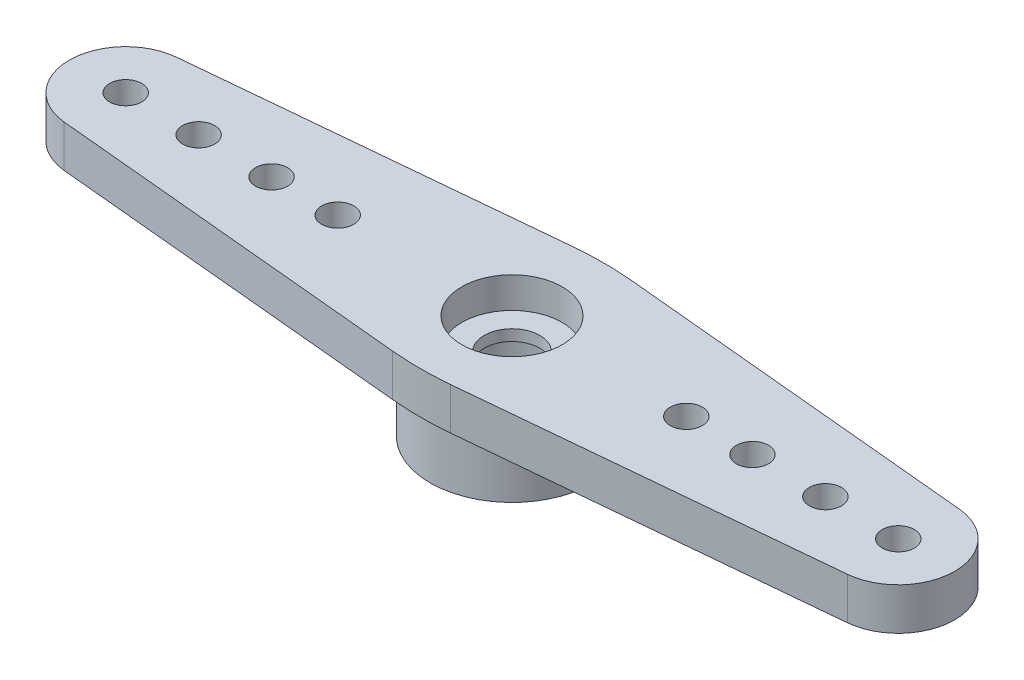
ISO-10303-21;
HEADER;
FILE_DESCRIPTION(('STEP AP214'),'2;1');
FILE_NAME('part.step','',(''),(''),'','','');
FILE_SCHEMA(('AUTOMOTIVE_DESIGN { 1 0 10303 214 1 1 1 1 }'));
ENDSEC;
DATA;
#1=APPLICATION_CONTEXT('core data for automotive mechanical design processes');
#2=APPLICATION_PROTOCOL_DEFINITION('international standard','automotive_design',2000,#1);
#3=PRODUCT_CONTEXT('',#1,'mechanical');
#4=PRODUCT('Part','Part','',(#3));
#5=PRODUCT_RELATED_PRODUCT_CATEGORY('part','',(#4));
#6=PRODUCT_DEFINITION_FORMATION('','',#4);
#7=PRODUCT_DEFINITION_CONTEXT('part definition',#1,'design');
#8=PRODUCT_DEFINITION('design','',#6,#7);
#9=PRODUCT_DEFINITION_SHAPE('','',#8);
#10=(LENGTH_UNIT() NAMED_UNIT(*) SI_UNIT(.MILLI.,.METRE.));
#11=(NAMED_UNIT(*) PLANE_ANGLE_UNIT() SI_UNIT($,.RADIAN.));
#12=(NAMED_UNIT(*) SI_UNIT($,.STERADIAN.) SOLID_ANGLE_UNIT());
#13=UNCERTAINTY_MEASURE_WITH_UNIT(LENGTH_MEASURE(1.E-05),#10,'distance_accuracy_value','');
#14=(GEOMETRIC_REPRESENTATION_CONTEXT(3) GLOBAL_UNCERTAINTY_ASSIGNED_CONTEXT((#13)) GLOBAL_UNIT_ASSIGNED_CONTEXT((#10,
#11,#12)) REPRESENTATION_CONTEXT('',''));
#15=CARTESIAN_POINT('',(0.,0.,0.));
#16=DIRECTION('',(0.,0.,1.));
#17=DIRECTION('',(1.,0.,0.));
#18=AXIS2_PLACEMENT_3D('',#15,#16,#17);
#19=CARTESIAN_POINT('',(0.,4.2672,0.));
#20=DIRECTION('',(0.,-1.,0.));
#21=DIRECTION('',(0.,0.,-1.));
#22=AXIS2_PLACEMENT_3D('',#19,#20,#21);
#23=CYLINDRICAL_SURFACE('',#22,1.143);
#24=CARTESIAN_POINT('',(0.,2.54,0.));
#25=DIRECTION('',(0.,1.,0.));
#26=DIRECTION('',(0.,0.,1.));
#27=AXIS2_PLACEMENT_3D('',#24,#25,#26);
#28=CIRCLE('',#27,1.143);
#29=CARTESIAN_POINT('',(0.,2.54,1.143));
#30=VERTEX_POINT('',#29);
#31=EDGE_CURVE('E196',#30,#30,#28,.T.);
#32=ORIENTED_EDGE('',*,*,#31,.F.);
#33=EDGE_LOOP('',(#32));
#34=FACE_BOUND('',#33,.T.);
#35=CARTESIAN_POINT('',(0.,2.9972,0.));
#36=DIRECTION('',(0.,1.,0.));
#37=DIRECTION('',(0.,0.,1.));
#38=AXIS2_PLACEMENT_3D('',#35,#36,#37);
#39=CIRCLE('',#38,1.143);
#40=CARTESIAN_POINT('',(0.,2.9972,1.143));
#41=VERTEX_POINT('',#40);
#42=EDGE_CURVE('E356',#41,#41,#39,.F.);
#43=ORIENTED_EDGE('',*,*,#42,.F.);
#44=EDGE_LOOP('',(#43));
#45=FACE_BOUND('',#44,.T.);
#46=ADVANCED_FACE('F34',(#34,#45),#23,.F.);
#47=CARTESIAN_POINT('',(0.,0.,0.));
#48=DIRECTION('',(0.,1.,0.));
#49=DIRECTION('',(0.,0.,1.));
#50=AXIS2_PLACEMENT_3D('',#47,#48,#49);
#51=PLANE('',#50);
#52=CARTESIAN_POINT('',(0.,0.,0.));
#53=DIRECTION('',(0.,1.,0.));
#54=DIRECTION('',(0.,0.,1.));
#55=AXIS2_PLACEMENT_3D('',#52,#53,#54);
#56=CIRCLE('',#55,3.3655);
#57=CARTESIAN_POINT('',(0.,0.,3.3655));
#58=VERTEX_POINT('',#57);
#59=EDGE_CURVE('E210',#58,#58,#56,.T.);
#60=ORIENTED_EDGE('',*,*,#59,.F.);
#61=EDGE_LOOP('',(#60));
#62=FACE_BOUND('',#61,.T.);
#63=CARTESIAN_POINT('',(0.,0.,0.));
#64=DIRECTION('',(0.,1.,0.));
#65=DIRECTION('',(0.,0.,1.));
#66=AXIS2_PLACEMENT_3D('',#63,#64,#65);
#67=CIRCLE('',#66,2.2352);
#68=CARTESIAN_POINT('',(0.,0.,2.2352));
#69=VERTEX_POINT('',#68);
#70=EDGE_CURVE('E207',#69,#69,#67,.T.);
#71=ORIENTED_EDGE('',*,*,#70,.T.);
#72=EDGE_LOOP('',(#71));
#73=FACE_BOUND('',#72,.T.);
#74=ADVANCED_FACE('F257',(#62,#73),#51,.F.);
#75=CARTESIAN_POINT('',(0.,2.54,0.));
#76=DIRECTION('',(0.,-1.,0.));
#77=DIRECTION('',(0.,0.,-1.));
#78=AXIS2_PLACEMENT_3D('',#75,#76,#77);
#79=CYLINDRICAL_SURFACE('',#78,3.3655);
#80=CARTESIAN_POINT('',(0.,2.54,0.));
#81=DIRECTION('',(0.,1.,0.));
#82=DIRECTION('',(0.,0.,1.));
#83=AXIS2_PLACEMENT_3D('',#80,#81,#82);
#84=CIRCLE('',#83,3.3655);
#85=CARTESIAN_POINT('',(0.,2.54,3.3655));
#86=VERTEX_POINT('',#85);
#87=EDGE_CURVE('E211',#86,#86,#84,.T.);
#88=ORIENTED_EDGE('',*,*,#87,.F.);
#89=EDGE_LOOP('',(#88));
#90=FACE_BOUND('',#89,.T.);
#91=ORIENTED_EDGE('',*,*,#59,.T.);
#92=EDGE_LOOP('',(#91));
#93=FACE_BOUND('',#92,.T.);
#94=ADVANCED_FACE('F263',(#90,#93),#79,.T.);
#95=CARTESIAN_POINT('',(0.,2.54,0.));
#96=DIRECTION('',(0.,-1.,0.));
#97=DIRECTION('',(0.,0.,-1.));
#98=AXIS2_PLACEMENT_3D('',#95,#96,#97);
#99=CYLINDRICAL_SURFACE('',#98,2.2352);
#100=CARTESIAN_POINT('',(0.,2.54,0.));
#101=DIRECTION('',(0.,1.,0.));
#102=DIRECTION('',(0.,0.,1.));
#103=AXIS2_PLACEMENT_3D('',#100,#101,#102);
#104=CIRCLE('',#103,2.2352);
#105=CARTESIAN_POINT('',(0.,2.54,2.2352));
#106=VERTEX_POINT('',#105);
#107=EDGE_CURVE('E119',#106,#106,#104,.T.);
#108=ORIENTED_EDGE('',*,*,#107,.T.);
#109=EDGE_LOOP('',(#108));
#110=FACE_BOUND('',#109,.T.);
#111=ORIENTED_EDGE('',*,*,#70,.F.);
#112=EDGE_LOOP('',(#111));
#113=FACE_BOUND('',#112,.T.);
#114=ADVANCED_FACE('F316',(#110,#113),#99,.F.);
#115=CARTESIAN_POINT('',(0.,2.54,0.));
#116=DIRECTION('',(0.,1.,0.));
#117=DIRECTION('',(0.,0.,1.));
#118=AXIS2_PLACEMENT_3D('',#115,#116,#117);
#119=PLANE('',#118);
#120=CARTESIAN_POINT('',(-9.8806,2.54,0.));
#121=DIRECTION('',(0.,1.,0.));
#122=DIRECTION('',(0.,0.,1.));
#123=AXIS2_PLACEMENT_3D('',#120,#121,#122);
#124=CIRCLE('',#123,0.6604);
#125=CARTESIAN_POINT('',(-9.8806,2.54,0.6604));
#126=VERTEX_POINT('',#125);
#127=EDGE_CURVE('E159',#126,#126,#124,.F.);
#128=ORIENTED_EDGE('',*,*,#127,.F.);
#129=EDGE_LOOP('',(#128));
#130=FACE_BOUND('',#129,.T.);
#131=DIRECTION('',(-0.995596740434201,0.,0.0937396950965555));
#132=VECTOR('',#131,1.);
#133=CARTESIAN_POINT('',(-0.356760873994165,2.54,-3.78910943647926));
#134=LINE('',#133,#132);
#135=CARTESIAN_POINT('',(-1.19049412772625,2.54,-3.71060988156648));
#136=VERTEX_POINT('',#135);
#137=CARTESIAN_POINT('',(-16.09226517831,2.54,-2.30754434514137));
#138=VERTEX_POINT('',#137);
#139=EDGE_CURVE('E115',#136,#138,#134,.T.);
#140=ORIENTED_EDGE('',*,*,#139,.F.);
#141=CARTESIAN_POINT('',(0.,2.54,8.93346872194787));
#142=DIRECTION('',(0.,1.,0.));
#143=DIRECTION('',(0.,0.,1.));
#144=AXIS2_PLACEMENT_3D('',#141,#142,#143);
#145=CIRCLE('',#144,12.7);
#146=CARTESIAN_POINT('',(1.19049412772625,2.54,-3.71060988156648));
#147=VERTEX_POINT('',#146);
#148=EDGE_CURVE('E220',#136,#147,#145,.F.);
#149=ORIENTED_EDGE('',*,*,#148,.T.);
#150=DIRECTION('',(0.995596740434201,0.,0.0937396950965555));
#151=VECTOR('',#150,1.);
#152=CARTESIAN_POINT('',(0.356760873994165,2.54,-3.78910943647926));
#153=LINE('',#152,#151);
#154=CARTESIAN_POINT('',(16.09226517831,2.54,-2.30754434514137));
#155=VERTEX_POINT('',#154);
#156=EDGE_CURVE('E173',#147,#155,#153,.T.);
#157=ORIENTED_EDGE('',*,*,#156,.T.);
#158=CARTESIAN_POINT('',(15.875,2.54,0.));
#159=DIRECTION('',(0.,1.,0.));
#160=DIRECTION('',(0.,0.,1.));
#161=AXIS2_PLACEMENT_3D('',#158,#159,#160);
#162=CIRCLE('',#161,2.31775);
#163=CARTESIAN_POINT('',(16.09226517831,2.54,2.30754434514137));
#164=VERTEX_POINT('',#163);
#165=EDGE_CURVE('E170',#164,#155,#162,.T.);
#166=ORIENTED_EDGE('',*,*,#165,.F.);
#167=DIRECTION('',(0.995596740434201,0.,-0.0937396950965555));
#168=VECTOR('',#167,1.);
#169=CARTESIAN_POINT('',(0.356760873994165,2.54,3.78910943647926));
#170=LINE('',#169,#168);
#171=CARTESIAN_POINT('',(1.19049412772625,2.54,3.71060988156648));
#172=VERTEX_POINT('',#171);
#173=EDGE_CURVE('E168',#172,#164,#170,.T.);
#174=ORIENTED_EDGE('',*,*,#173,.F.);
#175=CARTESIAN_POINT('',(0.,2.54,-8.93346872194787));
#176=DIRECTION('',(0.,1.,0.));
#177=DIRECTION('',(0.,0.,1.));
#178=AXIS2_PLACEMENT_3D('',#175,#176,#177);
#179=CIRCLE('',#178,12.7);
#180=CARTESIAN_POINT('',(-1.19049412772625,2.54,3.71060988156648));
#181=VERTEX_POINT('',#180);
#182=EDGE_CURVE('E218',#172,#181,#179,.F.);
#183=ORIENTED_EDGE('',*,*,#182,.T.);
#184=DIRECTION('',(-0.995596740434201,0.,-0.0937396950965555));
#185=VECTOR('',#184,1.);
#186=CARTESIAN_POINT('',(-0.356760873994165,2.54,3.78910943647926));
#187=LINE('',#186,#185);
#188=CARTESIAN_POINT('',(-16.09226517831,2.54,2.30754434514137));
#189=VERTEX_POINT('',#188);
#190=EDGE_CURVE('E166',#181,#189,#187,.T.);
#191=ORIENTED_EDGE('',*,*,#190,.T.);
#192=CARTESIAN_POINT('',(-15.875,2.54,0.));
#193=DIRECTION('',(0.,1.,0.));
#194=DIRECTION('',(0.,0.,1.));
#195=AXIS2_PLACEMENT_3D('',#192,#193,#194);
#196=CIRCLE('',#195,2.31775);
#197=EDGE_CURVE('E164',#189,#138,#196,.F.);
#198=ORIENTED_EDGE('',*,*,#197,.T.);
#199=EDGE_LOOP('',(#140,#149,#157,#166,#174,#183,#191,#198));
#200=FACE_BOUND('',#199,.T.);
#201=CARTESIAN_POINT('',(-7.1628,2.54,0.));
#202=DIRECTION('',(0.,1.,0.));
#203=DIRECTION('',(0.,0.,1.));
#204=AXIS2_PLACEMENT_3D('',#201,#202,#203);
#205=CIRCLE('',#204,0.6604);
#206=CARTESIAN_POINT('',(-7.1628,2.54,0.6604));
#207=VERTEX_POINT('',#206);
#208=EDGE_CURVE('E175',#207,#207,#205,.F.);
#209=ORIENTED_EDGE('',*,*,#208,.F.);
#210=EDGE_LOOP('',(#209));
#211=FACE_BOUND('',#210,.T.);
#212=CARTESIAN_POINT('',(-12.8778,2.54,0.));
#213=DIRECTION('',(0.,1.,0.));
#214=DIRECTION('',(0.,0.,1.));
#215=AXIS2_PLACEMENT_3D('',#212,#213,#214);
#216=CIRCLE('',#215,0.660399999999998);
#217=CARTESIAN_POINT('',(-12.8778,2.54,0.660399999999998));
#218=VERTEX_POINT('',#217);
#219=EDGE_CURVE('E178',#218,#218,#216,.F.);
#220=ORIENTED_EDGE('',*,*,#219,.F.);
#221=EDGE_LOOP('',(#220));
#222=FACE_BOUND('',#221,.T.);
#223=CARTESIAN_POINT('',(-15.875,2.54,0.));
#224=DIRECTION('',(0.,1.,0.));
#225=DIRECTION('',(0.,0.,1.));
#226=AXIS2_PLACEMENT_3D('',#223,#224,#225);
#227=CIRCLE('',#226,0.660399999999998);
#228=CARTESIAN_POINT('',(-15.875,2.54,0.660399999999998));
#229=VERTEX_POINT('',#228);
#230=EDGE_CURVE('E181',#229,#229,#227,.F.);
#231=ORIENTED_EDGE('',*,*,#230,.F.);
#232=EDGE_LOOP('',(#231));
#233=FACE_BOUND('',#232,.T.);
#234=CARTESIAN_POINT('',(12.8778,2.54,0.));
#235=DIRECTION('',(0.,1.,0.));
#236=DIRECTION('',(0.,0.,1.));
#237=AXIS2_PLACEMENT_3D('',#234,#235,#236);
#238=CIRCLE('',#237,0.660399999999998);
#239=CARTESIAN_POINT('',(12.8778,2.54,0.660399999999998));
#240=VERTEX_POINT('',#239);
#241=EDGE_CURVE('E184',#240,#240,#238,.T.);
#242=ORIENTED_EDGE('',*,*,#241,.T.);
#243=EDGE_LOOP('',(#242));
#244=FACE_BOUND('',#243,.T.);
#245=CARTESIAN_POINT('',(9.8806,2.54,0.));
#246=DIRECTION('',(0.,1.,0.));
#247=DIRECTION('',(0.,0.,1.));
#248=AXIS2_PLACEMENT_3D('',#245,#246,#247);
#249=CIRCLE('',#248,0.6604);
#250=CARTESIAN_POINT('',(9.8806,2.54,0.6604));
#251=VERTEX_POINT('',#250);
#252=EDGE_CURVE('E187',#251,#251,#249,.T.);
#253=ORIENTED_EDGE('',*,*,#252,.T.);
#254=EDGE_LOOP('',(#253));
#255=FACE_BOUND('',#254,.T.);
#256=CARTESIAN_POINT('',(7.1628,2.54,0.));
#257=DIRECTION('',(0.,1.,0.));
#258=DIRECTION('',(0.,0.,1.));
#259=AXIS2_PLACEMENT_3D('',#256,#257,#258);
#260=CIRCLE('',#259,0.6604);
#261=CARTESIAN_POINT('',(7.1628,2.54,0.6604));
#262=VERTEX_POINT('',#261);
#263=EDGE_CURVE('E190',#262,#262,#260,.T.);
#264=ORIENTED_EDGE('',*,*,#263,.T.);
#265=EDGE_LOOP('',(#264));
#266=FACE_BOUND('',#265,.T.);
#267=CARTESIAN_POINT('',(15.875,2.54,0.));
#268=DIRECTION('',(0.,1.,0.));
#269=DIRECTION('',(0.,0.,1.));
#270=AXIS2_PLACEMENT_3D('',#267,#268,#269);
#271=CIRCLE('',#270,0.660399999999998);
#272=CARTESIAN_POINT('',(15.875,2.54,0.660399999999998));
#273=VERTEX_POINT('',#272);
#274=EDGE_CURVE('E193',#273,#273,#271,.T.);
#275=ORIENTED_EDGE('',*,*,#274,.T.);
#276=EDGE_LOOP('',(#275));
#277=FACE_BOUND('',#276,.T.);
#278=ORIENTED_EDGE('',*,*,#87,.T.);
#279=EDGE_LOOP('',(#278));
#280=FACE_BOUND('',#279,.T.);
#281=ADVANCED_FACE('F234',(#130,#200,#211,#222,#233,#244,#255,#266,#277,#280),#119,.F.);
#282=CARTESIAN_POINT('',(-0.356760873994165,4.2672,-3.78910943647926));
#283=DIRECTION('',(0.0937396950965555,0.,0.995596740434201));
#284=DIRECTION('',(0.995596740434201,0.,-0.0937396950965555));
#285=AXIS2_PLACEMENT_3D('',#282,#283,#284);
#286=PLANE('',#285);
#287=DIRECTION('',(-0.995596740434201,0.,0.0937396950965555));
#288=VECTOR('',#287,1.);
#289=CARTESIAN_POINT('',(-0.356760873994165,4.2672,-3.78910943647926));
#290=LINE('',#289,#288);
#291=CARTESIAN_POINT('',(-1.19049412772625,4.2672,-3.71060988156648));
#292=VERTEX_POINT('',#291);
#293=CARTESIAN_POINT('',(-16.09226517831,4.2672,-2.30754434514137));
#294=VERTEX_POINT('',#293);
#295=EDGE_CURVE('E97',#292,#294,#290,.T.);
#296=ORIENTED_EDGE('',*,*,#295,.F.);
#297=DIRECTION('',(0.,-1.,0.));
#298=VECTOR('',#297,1.);
#299=CARTESIAN_POINT('',(-1.19049412772625,2.54,-3.71060988156648));
#300=LINE('',#299,#298);
#301=EDGE_CURVE('E214',#292,#136,#300,.T.);
#302=ORIENTED_EDGE('',*,*,#301,.T.);
#303=ORIENTED_EDGE('',*,*,#139,.T.);
#304=DIRECTION('',(0.,-1.,0.));
#305=VECTOR('',#304,1.);
#306=CARTESIAN_POINT('',(-16.09226517831,4.2672,-2.30754434514137));
#307=LINE('',#306,#305);
#308=EDGE_CURVE('E112',#294,#138,#307,.T.);
#309=ORIENTED_EDGE('',*,*,#308,.F.);
#310=EDGE_LOOP('',(#296,#302,#303,#309));
#311=FACE_BOUND('',#310,.T.);
#312=ADVANCED_FACE('F113',(#311),#286,.F.);
#313=CARTESIAN_POINT('',(-15.875,4.2672,0.));
#314=DIRECTION('',(0.,-1.,0.));
#315=DIRECTION('',(0.,0.,-1.));
#316=AXIS2_PLACEMENT_3D('',#313,#314,#315);
#317=CYLINDRICAL_SURFACE('',#316,2.31775);
#318=ORIENTED_EDGE('',*,*,#197,.F.);
#319=DIRECTION('',(0.,-1.,0.));
#320=VECTOR('',#319,1.);
#321=CARTESIAN_POINT('',(-16.09226517831,4.2672,2.30754434514137));
#322=LINE('',#321,#320);
#323=CARTESIAN_POINT('',(-16.09226517831,4.2672,2.30754434514137));
#324=VERTEX_POINT('',#323);
#325=EDGE_CURVE('E120',#324,#189,#322,.T.);
#326=ORIENTED_EDGE('',*,*,#325,.F.);
#327=CARTESIAN_POINT('',(-15.875,4.2672,0.));
#328=DIRECTION('',(0.,1.,0.));
#329=DIRECTION('',(0.,0.,1.));
#330=AXIS2_PLACEMENT_3D('',#327,#328,#329);
#331=CIRCLE('',#330,2.31775);
#332=EDGE_CURVE('E103',#324,#294,#331,.F.);
#333=ORIENTED_EDGE('',*,*,#332,.T.);
#334=ORIENTED_EDGE('',*,*,#308,.T.);
#335=EDGE_LOOP('',(#318,#326,#333,#334));
#336=FACE_BOUND('',#335,.T.);
#337=ADVANCED_FACE('F123',(#336),#317,.T.);
#338=CARTESIAN_POINT('',(-0.356760873994165,4.2672,3.78910943647926));
#339=DIRECTION('',(-0.0937396950965555,0.,0.995596740434201));
#340=DIRECTION('',(0.995596740434201,0.,0.0937396950965555));
#341=AXIS2_PLACEMENT_3D('',#338,#339,#340);
#342=PLANE('',#341);
#343=ORIENTED_EDGE('',*,*,#190,.F.);
#344=DIRECTION('',(0.,-1.,0.));
#345=VECTOR('',#344,1.);
#346=CARTESIAN_POINT('',(-1.19049412772625,4.2672,3.71060988156648));
#347=LINE('',#346,#345);
#348=CARTESIAN_POINT('',(-1.19049412772625,4.2672,3.71060988156648));
#349=VERTEX_POINT('',#348);
#350=EDGE_CURVE('E11',#181,#349,#347,.F.);
#351=ORIENTED_EDGE('',*,*,#350,.T.);
#352=DIRECTION('',(-0.995596740434201,0.,-0.0937396950965555));
#353=VECTOR('',#352,1.);
#354=CARTESIAN_POINT('',(-0.356760873994165,4.2672,3.78910943647926));
#355=LINE('',#354,#353);
#356=EDGE_CURVE('E125',#349,#324,#355,.T.);
#357=ORIENTED_EDGE('',*,*,#356,.T.);
#358=ORIENTED_EDGE('',*,*,#325,.T.);
#359=EDGE_LOOP('',(#343,#351,#357,#358));
#360=FACE_BOUND('',#359,.T.);
#361=ADVANCED_FACE('F245',(#360),#342,.T.);
#362=CARTESIAN_POINT('',(0.356760873994165,4.2672,3.78910943647926));
#363=DIRECTION('',(-0.0937396950965555,0.,-0.995596740434201));
#364=DIRECTION('',(-0.995596740434201,0.,0.0937396950965555));
#365=AXIS2_PLACEMENT_3D('',#362,#363,#364);
#366=PLANE('',#365);
#367=DIRECTION('',(0.995596740434201,0.,-0.0937396950965555));
#368=VECTOR('',#367,1.);
#369=CARTESIAN_POINT('',(0.356760873994165,4.2672,3.78910943647926));
#370=LINE('',#369,#368);
#371=CARTESIAN_POINT('',(1.19049412772625,4.2672,3.71060988156648));
#372=VERTEX_POINT('',#371);
#373=CARTESIAN_POINT('',(16.09226517831,4.2672,2.30754434514137));
#374=VERTEX_POINT('',#373);
#375=EDGE_CURVE('E127',#372,#374,#370,.T.);
#376=ORIENTED_EDGE('',*,*,#375,.F.);
#377=DIRECTION('',(0.,-1.,0.));
#378=VECTOR('',#377,1.);
#379=CARTESIAN_POINT('',(1.19049412772625,2.54,3.71060988156648));
#380=LINE('',#379,#378);
#381=EDGE_CURVE('E42',#372,#172,#380,.T.);
#382=ORIENTED_EDGE('',*,*,#381,.T.);
#383=ORIENTED_EDGE('',*,*,#173,.T.);
#384=DIRECTION('',(0.,-1.,0.));
#385=VECTOR('',#384,1.);
#386=CARTESIAN_POINT('',(16.09226517831,4.2672,2.30754434514137));
#387=LINE('',#386,#385);
#388=EDGE_CURVE('E201',#374,#164,#387,.T.);
#389=ORIENTED_EDGE('',*,*,#388,.F.);
#390=EDGE_LOOP('',(#376,#382,#383,#389));
#391=FACE_BOUND('',#390,.T.);
#392=ADVANCED_FACE('F229',(#391),#366,.F.);
#393=CARTESIAN_POINT('',(15.875,4.2672,0.));
#394=DIRECTION('',(0.,-1.,0.));
#395=DIRECTION('',(0.,0.,-1.));
#396=AXIS2_PLACEMENT_3D('',#393,#394,#395);
#397=CYLINDRICAL_SURFACE('',#396,2.31775);
#398=ORIENTED_EDGE('',*,*,#165,.T.);
#399=DIRECTION('',(0.,-1.,0.));
#400=VECTOR('',#399,1.);
#401=CARTESIAN_POINT('',(16.09226517831,4.2672,-2.30754434514137));
#402=LINE('',#401,#400);
#403=CARTESIAN_POINT('',(16.09226517831,4.2672,-2.30754434514137));
#404=VERTEX_POINT('',#403);
#405=EDGE_CURVE('E158',#404,#155,#402,.T.);
#406=ORIENTED_EDGE('',*,*,#405,.F.);
#407=CARTESIAN_POINT('',(15.875,4.2672,0.));
#408=DIRECTION('',(0.,1.,0.));
#409=DIRECTION('',(0.,0.,1.));
#410=AXIS2_PLACEMENT_3D('',#407,#408,#409);
#411=CIRCLE('',#410,2.31775);
#412=EDGE_CURVE('E132',#374,#404,#411,.T.);
#413=ORIENTED_EDGE('',*,*,#412,.F.);
#414=ORIENTED_EDGE('',*,*,#388,.T.);
#415=EDGE_LOOP('',(#398,#406,#413,#414));
#416=FACE_BOUND('',#415,.T.);
#417=ADVANCED_FACE('F239',(#416),#397,.T.);
#418=CARTESIAN_POINT('',(15.875,4.2672,0.));
#419=DIRECTION('',(0.,-1.,0.));
#420=DIRECTION('',(0.,0.,-1.));
#421=AXIS2_PLACEMENT_3D('',#418,#419,#420);
#422=CYLINDRICAL_SURFACE('',#421,0.660399999999998);
#423=CARTESIAN_POINT('',(15.875,4.2672,0.));
#424=DIRECTION('',(0.,1.,0.));
#425=DIRECTION('',(0.,0.,1.));
#426=AXIS2_PLACEMENT_3D('',#423,#424,#425);
#427=CIRCLE('',#426,0.660399999999998);
#428=CARTESIAN_POINT('',(15.875,4.2672,0.660399999999998));
#429=VERTEX_POINT('',#428);
#430=EDGE_CURVE('E155',#429,#429,#427,.T.);
#431=ORIENTED_EDGE('',*,*,#430,.T.);
#432=EDGE_LOOP('',(#431));
#433=FACE_BOUND('',#432,.T.);
#434=ORIENTED_EDGE('',*,*,#274,.F.);
#435=EDGE_LOOP('',(#434));
#436=FACE_BOUND('',#435,.T.);
#437=ADVANCED_FACE('F271',(#433,#436),#422,.F.);
#438=CARTESIAN_POINT('',(7.1628,4.2672,0.));
#439=DIRECTION('',(0.,-1.,0.));
#440=DIRECTION('',(0.,0.,-1.));
#441=AXIS2_PLACEMENT_3D('',#438,#439,#440);
#442=CYLINDRICAL_SURFACE('',#441,0.6604);
#443=CARTESIAN_POINT('',(7.1628,4.2672,0.));
#444=DIRECTION('',(0.,1.,0.));
#445=DIRECTION('',(0.,0.,1.));
#446=AXIS2_PLACEMENT_3D('',#443,#444,#445);
#447=CIRCLE('',#446,0.6604);
#448=CARTESIAN_POINT('',(7.1628,4.2672,0.6604));
#449=VERTEX_POINT('',#448);
#450=EDGE_CURVE('E152',#449,#449,#447,.T.);
#451=ORIENTED_EDGE('',*,*,#450,.T.);
#452=EDGE_LOOP('',(#451));
#453=FACE_BOUND('',#452,.T.);
#454=ORIENTED_EDGE('',*,*,#263,.F.);
#455=EDGE_LOOP('',(#454));
#456=FACE_BOUND('',#455,.T.);
#457=ADVANCED_FACE('F274',(#453,#456),#442,.F.);
#458=CARTESIAN_POINT('',(9.8806,4.2672,0.));
#459=DIRECTION('',(0.,-1.,0.));
#460=DIRECTION('',(0.,0.,-1.));
#461=AXIS2_PLACEMENT_3D('',#458,#459,#460);
#462=CYLINDRICAL_SURFACE('',#461,0.6604);
#463=CARTESIAN_POINT('',(9.8806,4.2672,0.));
#464=DIRECTION('',(0.,1.,0.));
#465=DIRECTION('',(0.,0.,1.));
#466=AXIS2_PLACEMENT_3D('',#463,#464,#465);
#467=CIRCLE('',#466,0.6604);
#468=CARTESIAN_POINT('',(9.8806,4.2672,0.6604));
#469=VERTEX_POINT('',#468);
#470=EDGE_CURVE('E149',#469,#469,#467,.T.);
#471=ORIENTED_EDGE('',*,*,#470,.T.);
#472=EDGE_LOOP('',(#471));
#473=FACE_BOUND('',#472,.T.);
#474=ORIENTED_EDGE('',*,*,#252,.F.);
#475=EDGE_LOOP('',(#474));
#476=FACE_BOUND('',#475,.T.);
#477=ADVANCED_FACE('F278',(#473,#476),#462,.F.);
#478=CARTESIAN_POINT('',(12.8778,4.2672,0.));
#479=DIRECTION('',(0.,-1.,0.));
#480=DIRECTION('',(0.,0.,-1.));
#481=AXIS2_PLACEMENT_3D('',#478,#479,#480);
#482=CYLINDRICAL_SURFACE('',#481,0.660399999999998);
#483=CARTESIAN_POINT('',(12.8778,4.2672,0.));
#484=DIRECTION('',(0.,1.,0.));
#485=DIRECTION('',(0.,0.,1.));
#486=AXIS2_PLACEMENT_3D('',#483,#484,#485);
#487=CIRCLE('',#486,0.660399999999998);
#488=CARTESIAN_POINT('',(12.8778,4.2672,0.660399999999998));
#489=VERTEX_POINT('',#488);
#490=EDGE_CURVE('E146',#489,#489,#487,.T.);
#491=ORIENTED_EDGE('',*,*,#490,.T.);
#492=EDGE_LOOP('',(#491));
#493=FACE_BOUND('',#492,.T.);
#494=ORIENTED_EDGE('',*,*,#241,.F.);
#495=EDGE_LOOP('',(#494));
#496=FACE_BOUND('',#495,.T.);
#497=ADVANCED_FACE('F282',(#493,#496),#482,.F.);
#498=CARTESIAN_POINT('',(-15.875,4.2672,0.));
#499=DIRECTION('',(0.,-1.,0.));
#500=DIRECTION('',(0.,0.,-1.));
#501=AXIS2_PLACEMENT_3D('',#498,#499,#500);
#502=CYLINDRICAL_SURFACE('',#501,0.660399999999998);
#503=CARTESIAN_POINT('',(-15.875,4.2672,0.));
#504=DIRECTION('',(0.,1.,0.));
#505=DIRECTION('',(0.,0.,1.));
#506=AXIS2_PLACEMENT_3D('',#503,#504,#505);
#507=CIRCLE('',#506,0.660399999999998);
#508=CARTESIAN_POINT('',(-15.875,4.2672,0.660399999999998));
#509=VERTEX_POINT('',#508);
#510=EDGE_CURVE('E143',#509,#509,#507,.F.);
#511=ORIENTED_EDGE('',*,*,#510,.F.);
#512=EDGE_LOOP('',(#511));
#513=FACE_BOUND('',#512,.T.);
#514=ORIENTED_EDGE('',*,*,#230,.T.);
#515=EDGE_LOOP('',(#514));
#516=FACE_BOUND('',#515,.T.);
#517=ADVANCED_FACE('F286',(#513,#516),#502,.F.);
#518=CARTESIAN_POINT('',(-12.8778,4.2672,0.));
#519=DIRECTION('',(0.,-1.,0.));
#520=DIRECTION('',(0.,0.,-1.));
#521=AXIS2_PLACEMENT_3D('',#518,#519,#520);
#522=CYLINDRICAL_SURFACE('',#521,0.660399999999998);
#523=CARTESIAN_POINT('',(-12.8778,4.2672,0.));
#524=DIRECTION('',(0.,1.,0.));
#525=DIRECTION('',(0.,0.,1.));
#526=AXIS2_PLACEMENT_3D('',#523,#524,#525);
#527=CIRCLE('',#526,0.660399999999998);
#528=CARTESIAN_POINT('',(-12.8778,4.2672,0.660399999999998));
#529=VERTEX_POINT('',#528);
#530=EDGE_CURVE('E140',#529,#529,#527,.F.);
#531=ORIENTED_EDGE('',*,*,#530,.F.);
#532=EDGE_LOOP('',(#531));
#533=FACE_BOUND('',#532,.T.);
#534=ORIENTED_EDGE('',*,*,#219,.T.);
#535=EDGE_LOOP('',(#534));
#536=FACE_BOUND('',#535,.T.);
#537=ADVANCED_FACE('F290',(#533,#536),#522,.F.);
#538=CARTESIAN_POINT('',(-7.1628,4.2672,0.));
#539=DIRECTION('',(0.,-1.,0.));
#540=DIRECTION('',(0.,0.,-1.));
#541=AXIS2_PLACEMENT_3D('',#538,#539,#540);
#542=CYLINDRICAL_SURFACE('',#541,0.6604);
#543=CARTESIAN_POINT('',(-7.1628,4.2672,0.));
#544=DIRECTION('',(0.,1.,0.));
#545=DIRECTION('',(0.,0.,1.));
#546=AXIS2_PLACEMENT_3D('',#543,#544,#545);
#547=CIRCLE('',#546,0.6604);
#548=CARTESIAN_POINT('',(-7.1628,4.2672,0.6604));
#549=VERTEX_POINT('',#548);
#550=EDGE_CURVE('E137',#549,#549,#547,.F.);
#551=ORIENTED_EDGE('',*,*,#550,.F.);
#552=EDGE_LOOP('',(#551));
#553=FACE_BOUND('',#552,.T.);
#554=ORIENTED_EDGE('',*,*,#208,.T.);
#555=EDGE_LOOP('',(#554));
#556=FACE_BOUND('',#555,.T.);
#557=ADVANCED_FACE('F294',(#553,#556),#542,.F.);
#558=CARTESIAN_POINT('',(0.356760873994165,4.2672,-3.78910943647926));
#559=DIRECTION('',(0.0937396950965555,0.,-0.995596740434201));
#560=DIRECTION('',(-0.995596740434201,0.,-0.0937396950965555));
#561=AXIS2_PLACEMENT_3D('',#558,#559,#560);
#562=PLANE('',#561);
#563=ORIENTED_EDGE('',*,*,#156,.F.);
#564=DIRECTION('',(0.,-1.,0.));
#565=VECTOR('',#564,1.);
#566=CARTESIAN_POINT('',(1.19049412772625,4.2672,-3.71060988156648));
#567=LINE('',#566,#565);
#568=CARTESIAN_POINT('',(1.19049412772625,4.2672,-3.71060988156648));
#569=VERTEX_POINT('',#568);
#570=EDGE_CURVE('E222',#147,#569,#567,.F.);
#571=ORIENTED_EDGE('',*,*,#570,.T.);
#572=DIRECTION('',(0.995596740434201,0.,0.0937396950965555));
#573=VECTOR('',#572,1.);
#574=CARTESIAN_POINT('',(0.356760873994165,4.2672,-3.78910943647926));
#575=LINE('',#574,#573);
#576=EDGE_CURVE('E135',#569,#404,#575,.T.);
#577=ORIENTED_EDGE('',*,*,#576,.T.);
#578=ORIENTED_EDGE('',*,*,#405,.T.);
#579=EDGE_LOOP('',(#563,#571,#577,#578));
#580=FACE_BOUND('',#579,.T.);
#581=ADVANCED_FACE('F298',(#580),#562,.T.);
#582=CARTESIAN_POINT('',(-9.8806,4.2672,0.));
#583=DIRECTION('',(0.,-1.,0.));
#584=DIRECTION('',(0.,0.,-1.));
#585=AXIS2_PLACEMENT_3D('',#582,#583,#584);
#586=CYLINDRICAL_SURFACE('',#585,0.6604);
#587=CARTESIAN_POINT('',(-9.8806,4.2672,0.));
#588=DIRECTION('',(0.,1.,0.));
#589=DIRECTION('',(0.,0.,1.));
#590=AXIS2_PLACEMENT_3D('',#587,#588,#589);
#591=CIRCLE('',#590,0.6604);
#592=CARTESIAN_POINT('',(-9.8806,4.2672,0.6604));
#593=VERTEX_POINT('',#592);
#594=EDGE_CURVE('E109',#593,#593,#591,.F.);
#595=ORIENTED_EDGE('',*,*,#594,.F.);
#596=EDGE_LOOP('',(#595));
#597=FACE_BOUND('',#596,.T.);
#598=ORIENTED_EDGE('',*,*,#127,.T.);
#599=EDGE_LOOP('',(#598));
#600=FACE_BOUND('',#599,.T.);
#601=ADVANCED_FACE('F302',(#597,#600),#586,.F.);
#602=CARTESIAN_POINT('',(0.,4.2672,0.));
#603=DIRECTION('',(0.,1.,0.));
#604=DIRECTION('',(0.,0.,1.));
#605=AXIS2_PLACEMENT_3D('',#602,#603,#604);
#606=PLANE('',#605);
#607=CARTESIAN_POINT('',(0.,4.2672,0.));
#608=DIRECTION('',(0.,1.,0.));
#609=DIRECTION('',(0.,0.,1.));
#610=AXIS2_PLACEMENT_3D('',#607,#608,#609);
#611=CIRCLE('',#610,2.06375);
#612=CARTESIAN_POINT('',(0.,4.2672,2.06375));
#613=VERTEX_POINT('',#612);
#614=EDGE_CURVE('E360',#613,#613,#611,.T.);
#615=ORIENTED_EDGE('',*,*,#614,.F.);
#616=EDGE_LOOP('',(#615));
#617=FACE_BOUND('',#616,.T.);
#618=ORIENTED_EDGE('',*,*,#594,.T.);
#619=EDGE_LOOP('',(#618));
#620=FACE_BOUND('',#619,.T.);
#621=ORIENTED_EDGE('',*,*,#576,.F.);
#622=CARTESIAN_POINT('',(0.,4.2672,8.93346872194787));
#623=DIRECTION('',(0.,1.,0.));
#624=DIRECTION('',(0.,0.,1.));
#625=AXIS2_PLACEMENT_3D('',#622,#623,#624);
#626=CIRCLE('',#625,12.7);
#627=EDGE_CURVE('E105',#569,#292,#626,.T.);
#628=ORIENTED_EDGE('',*,*,#627,.T.);
#629=ORIENTED_EDGE('',*,*,#295,.T.);
#630=ORIENTED_EDGE('',*,*,#332,.F.);
#631=ORIENTED_EDGE('',*,*,#356,.F.);
#632=CARTESIAN_POINT('',(0.,4.2672,-8.93346872194787));
#633=DIRECTION('',(0.,1.,0.));
#634=DIRECTION('',(0.,0.,1.));
#635=AXIS2_PLACEMENT_3D('',#632,#633,#634);
#636=CIRCLE('',#635,12.7);
#637=EDGE_CURVE('E49',#349,#372,#636,.T.);
#638=ORIENTED_EDGE('',*,*,#637,.T.);
#639=ORIENTED_EDGE('',*,*,#375,.T.);
#640=ORIENTED_EDGE('',*,*,#412,.T.);
#641=EDGE_LOOP('',(#621,#628,#629,#630,#631,#638,#639,#640));
#642=FACE_BOUND('',#641,.T.);
#643=ORIENTED_EDGE('',*,*,#550,.T.);
#644=EDGE_LOOP('',(#643));
#645=FACE_BOUND('',#644,.T.);
#646=ORIENTED_EDGE('',*,*,#530,.T.);
#647=EDGE_LOOP('',(#646));
#648=FACE_BOUND('',#647,.T.);
#649=ORIENTED_EDGE('',*,*,#510,.T.);
#650=EDGE_LOOP('',(#649));
#651=FACE_BOUND('',#650,.T.);
#652=ORIENTED_EDGE('',*,*,#490,.F.);
#653=EDGE_LOOP('',(#652));
#654=FACE_BOUND('',#653,.T.);
#655=ORIENTED_EDGE('',*,*,#470,.F.);
#656=EDGE_LOOP('',(#655));
#657=FACE_BOUND('',#656,.T.);
#658=ORIENTED_EDGE('',*,*,#450,.F.);
#659=EDGE_LOOP('',(#658));
#660=FACE_BOUND('',#659,.T.);
#661=ORIENTED_EDGE('',*,*,#430,.F.);
#662=EDGE_LOOP('',(#661));
#663=FACE_BOUND('',#662,.T.);
#664=ADVANCED_FACE('F100',(#617,#620,#642,#645,#648,#651,#654,#657,#660,#663),#606,.T.);
#665=ORIENTED_EDGE('',*,*,#107,.F.);
#666=EDGE_LOOP('',(#665));
#667=FACE_BOUND('',#666,.T.);
#668=ORIENTED_EDGE('',*,*,#31,.T.);
#669=EDGE_LOOP('',(#668));
#670=FACE_BOUND('',#669,.T.);
#671=ADVANCED_FACE('F255',(#667,#670),#119,.F.);
#672=CARTESIAN_POINT('',(0.,4.2672,8.93346872194787));
#673=DIRECTION('',(0.,1.,0.));
#674=DIRECTION('',(0.,0.,1.));
#675=AXIS2_PLACEMENT_3D('',#672,#673,#674);
#676=CYLINDRICAL_SURFACE('',#675,12.7);
#677=ORIENTED_EDGE('',*,*,#627,.F.);
#678=ORIENTED_EDGE('',*,*,#570,.F.);
#679=ORIENTED_EDGE('',*,*,#148,.F.);
#680=ORIENTED_EDGE('',*,*,#301,.F.);
#681=EDGE_LOOP('',(#677,#678,#679,#680));
#682=FACE_BOUND('',#681,.T.);
#683=ADVANCED_FACE('F244',(#682),#676,.T.);
#684=CARTESIAN_POINT('',(0.,4.2672,-8.93346872194787));
#685=DIRECTION('',(0.,1.,0.));
#686=DIRECTION('',(0.,0.,1.));
#687=AXIS2_PLACEMENT_3D('',#684,#685,#686);
#688=CYLINDRICAL_SURFACE('',#687,12.7);
#689=ORIENTED_EDGE('',*,*,#637,.F.);
#690=ORIENTED_EDGE('',*,*,#350,.F.);
#691=ORIENTED_EDGE('',*,*,#182,.F.);
#692=ORIENTED_EDGE('',*,*,#381,.F.);
#693=EDGE_LOOP('',(#689,#690,#691,#692));
#694=FACE_BOUND('',#693,.T.);
#695=ADVANCED_FACE('F36',(#694),#688,.T.);
#696=CARTESIAN_POINT('',(0.,2.9972,0.));
#697=DIRECTION('',(0.,1.,0.));
#698=DIRECTION('',(0.,0.,1.));
#699=AXIS2_PLACEMENT_3D('',#696,#697,#698);
#700=CYLINDRICAL_SURFACE('',#699,2.06375);
#701=CARTESIAN_POINT('',(0.,2.9972,0.));
#702=DIRECTION('',(0.,1.,0.));
#703=DIRECTION('',(0.,0.,1.));
#704=AXIS2_PLACEMENT_3D('',#701,#702,#703);
#705=CIRCLE('',#704,2.06375);
#706=CARTESIAN_POINT('',(0.,2.9972,2.06375));
#707=VERTEX_POINT('',#706);
#708=EDGE_CURVE('E162',#707,#707,#705,.T.);
#709=ORIENTED_EDGE('',*,*,#708,.F.);
#710=EDGE_LOOP('',(#709));
#711=FACE_BOUND('',#710,.T.);
#712=ORIENTED_EDGE('',*,*,#614,.T.);
#713=EDGE_LOOP('',(#712));
#714=FACE_BOUND('',#713,.T.);
#715=ADVANCED_FACE('F247',(#711,#714),#700,.F.);
#716=CARTESIAN_POINT('',(0.,2.9972,0.));
#717=DIRECTION('',(0.,1.,0.));
#718=DIRECTION('',(0.,0.,1.));
#719=AXIS2_PLACEMENT_3D('',#716,#717,#718);
#720=PLANE('',#719);
#721=ORIENTED_EDGE('',*,*,#42,.T.);
#722=EDGE_LOOP('',(#721));
#723=FACE_BOUND('',#722,.T.);
#724=ORIENTED_EDGE('',*,*,#708,.T.);
#725=EDGE_LOOP('',(#724));
#726=FACE_BOUND('',#725,.T.);
#727=ADVANCED_FACE('F252',(#723,#726),#720,.T.);
#728=CLOSED_SHELL('',(#46,#74,#94,#114,#281,#312,#337,#361,#392,#417,#437,#457,#477,#497,#517,
#537,#557,#581,#601,#664,#671,#683,#695,#715,#727));
#729=MANIFOLD_SOLID_BREP('B2',#728);
#730=ADVANCED_BREP_SHAPE_REPRESENTATION('',(#18,#729),#14);
#731=SHAPE_DEFINITION_REPRESENTATION(#9,#730);
ENDSEC;
END-ISO-10303-21;
